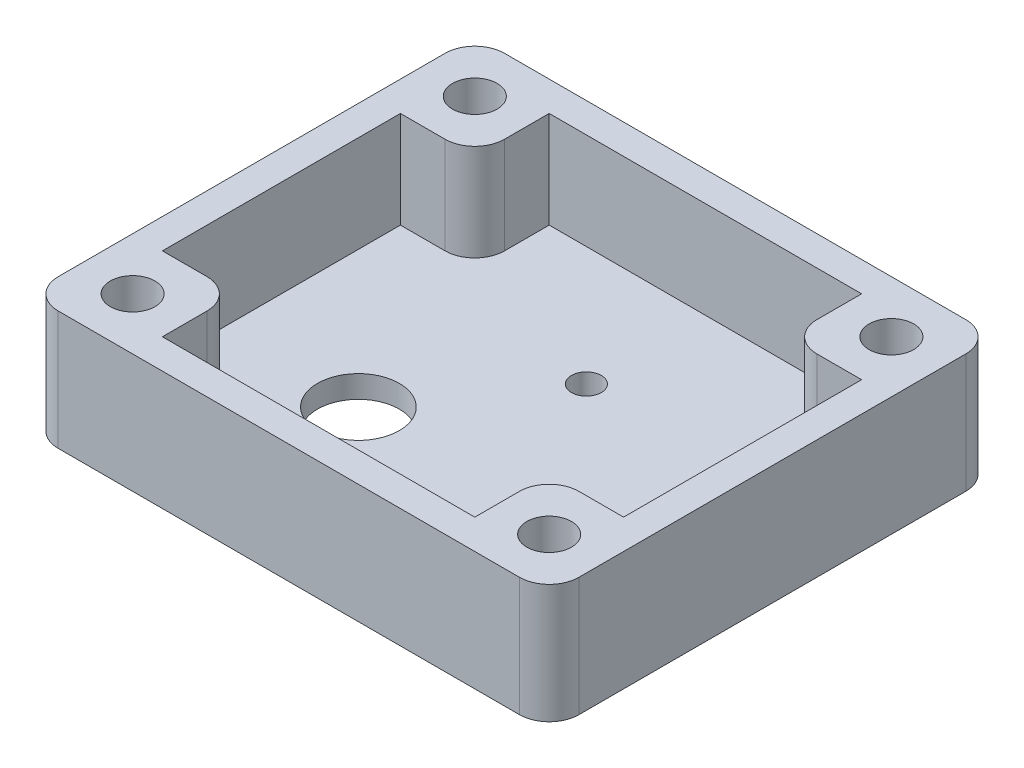
ISO-10303-21;
HEADER;
FILE_DESCRIPTION(('STEP AP214'),'2;1');
FILE_NAME('part.step','',(''),(''),'','','');
FILE_SCHEMA(('AUTOMOTIVE_DESIGN { 1 0 10303 214 1 1 1 1 }'));
ENDSEC;
DATA;
#1=APPLICATION_CONTEXT('core data for automotive mechanical design processes');
#2=APPLICATION_PROTOCOL_DEFINITION('international standard','automotive_design',2000,#1);
#3=PRODUCT_CONTEXT('',#1,'mechanical');
#4=PRODUCT('Part','Part','',(#3));
#5=PRODUCT_RELATED_PRODUCT_CATEGORY('part','',(#4));
#6=PRODUCT_DEFINITION_FORMATION('','',#4);
#7=PRODUCT_DEFINITION_CONTEXT('part definition',#1,'design');
#8=PRODUCT_DEFINITION('design','',#6,#7);
#9=PRODUCT_DEFINITION_SHAPE('','',#8);
#10=(LENGTH_UNIT() NAMED_UNIT(*) SI_UNIT(.MILLI.,.METRE.));
#11=(NAMED_UNIT(*) PLANE_ANGLE_UNIT() SI_UNIT($,.RADIAN.));
#12=(NAMED_UNIT(*) SI_UNIT($,.STERADIAN.) SOLID_ANGLE_UNIT());
#13=UNCERTAINTY_MEASURE_WITH_UNIT(LENGTH_MEASURE(1.E-05),#10,'distance_accuracy_value','');
#14=(GEOMETRIC_REPRESENTATION_CONTEXT(3) GLOBAL_UNCERTAINTY_ASSIGNED_CONTEXT((#13)) GLOBAL_UNIT_ASSIGNED_CONTEXT((#10,
#11,#12)) REPRESENTATION_CONTEXT('',''));
#15=CARTESIAN_POINT('',(0.,0.,0.));
#16=DIRECTION('',(0.,0.,1.));
#17=DIRECTION('',(1.,0.,0.));
#18=AXIS2_PLACEMENT_3D('',#15,#16,#17);
#19=CARTESIAN_POINT('',(0.,1.5,0.));
#20=DIRECTION('',(0.,1.,0.));
#21=DIRECTION('',(0.,0.,1.));
#22=AXIS2_PLACEMENT_3D('',#19,#20,#21);
#23=PLANE('',#22);
#24=DIRECTION('',(0.,0.,1.));
#25=VECTOR('',#24,1.);
#26=CARTESIAN_POINT('',(-10.5,1.5,-8.));
#27=LINE('',#26,#25);
#28=CARTESIAN_POINT('',(-10.5,1.5,-13.));
#29=VERTEX_POINT('',#28);
#30=CARTESIAN_POINT('',(-10.5,1.5,-10.));
#31=VERTEX_POINT('',#30);
#32=EDGE_CURVE('E259',#29,#31,#27,.T.);
#33=ORIENTED_EDGE('',*,*,#32,.T.);
#34=CARTESIAN_POINT('',(-12.5,1.5,-10.));
#35=DIRECTION('',(0.,1.,0.));
#36=DIRECTION('',(0.,0.,1.));
#37=AXIS2_PLACEMENT_3D('',#34,#35,#36);
#38=CIRCLE('',#37,2.);
#39=CARTESIAN_POINT('',(-12.5,1.5,-8.));
#40=VERTEX_POINT('',#39);
#41=EDGE_CURVE('E11',#31,#40,#38,.F.);
#42=ORIENTED_EDGE('',*,*,#41,.T.);
#43=DIRECTION('',(-1.,0.,0.));
#44=VECTOR('',#43,1.);
#45=CARTESIAN_POINT('',(-15.5,1.5,-8.));
#46=LINE('',#45,#44);
#47=CARTESIAN_POINT('',(-15.5,1.5,-8.));
#48=VERTEX_POINT('',#47);
#49=EDGE_CURVE('E262',#40,#48,#46,.T.);
#50=ORIENTED_EDGE('',*,*,#49,.T.);
#51=DIRECTION('',(0.,0.,1.));
#52=VECTOR('',#51,1.);
#53=CARTESIAN_POINT('',(-15.5,1.5,8.));
#54=LINE('',#53,#52);
#55=CARTESIAN_POINT('',(-15.5,1.5,8.));
#56=VERTEX_POINT('',#55);
#57=EDGE_CURVE('E216',#48,#56,#54,.T.);
#58=ORIENTED_EDGE('',*,*,#57,.T.);
#59=DIRECTION('',(1.,0.,0.));
#60=VECTOR('',#59,1.);
#61=CARTESIAN_POINT('',(-10.5,1.5,8.));
#62=LINE('',#61,#60);
#63=CARTESIAN_POINT('',(-12.5,1.5,8.));
#64=VERTEX_POINT('',#63);
#65=EDGE_CURVE('E268',#56,#64,#62,.T.);
#66=ORIENTED_EDGE('',*,*,#65,.T.);
#67=CARTESIAN_POINT('',(-12.5,1.5,10.));
#68=DIRECTION('',(0.,1.,0.));
#69=DIRECTION('',(0.,0.,1.));
#70=AXIS2_PLACEMENT_3D('',#67,#68,#69);
#71=CIRCLE('',#70,2.);
#72=CARTESIAN_POINT('',(-10.5,1.5,10.));
#73=VERTEX_POINT('',#72);
#74=EDGE_CURVE('E463',#64,#73,#71,.F.);
#75=ORIENTED_EDGE('',*,*,#74,.T.);
#76=DIRECTION('',(0.,0.,1.));
#77=VECTOR('',#76,1.);
#78=CARTESIAN_POINT('',(-10.5,1.5,13.));
#79=LINE('',#78,#77);
#80=CARTESIAN_POINT('',(-10.5,1.5,13.));
#81=VERTEX_POINT('',#80);
#82=EDGE_CURVE('E272',#73,#81,#79,.T.);
#83=ORIENTED_EDGE('',*,*,#82,.T.);
#84=DIRECTION('',(1.,0.,0.));
#85=VECTOR('',#84,1.);
#86=CARTESIAN_POINT('',(10.5,1.5,13.));
#87=LINE('',#86,#85);
#88=CARTESIAN_POINT('',(10.5,1.5,13.));
#89=VERTEX_POINT('',#88);
#90=EDGE_CURVE('E275',#81,#89,#87,.T.);
#91=ORIENTED_EDGE('',*,*,#90,.T.);
#92=DIRECTION('',(0.,0.,-1.));
#93=VECTOR('',#92,1.);
#94=CARTESIAN_POINT('',(10.5,1.5,8.));
#95=LINE('',#94,#93);
#96=CARTESIAN_POINT('',(10.5,1.5,10.));
#97=VERTEX_POINT('',#96);
#98=EDGE_CURVE('E278',#89,#97,#95,.T.);
#99=ORIENTED_EDGE('',*,*,#98,.T.);
#100=CARTESIAN_POINT('',(12.5,1.5,10.));
#101=DIRECTION('',(0.,1.,0.));
#102=DIRECTION('',(0.,0.,1.));
#103=AXIS2_PLACEMENT_3D('',#100,#101,#102);
#104=CIRCLE('',#103,2.);
#105=CARTESIAN_POINT('',(12.5,1.5,8.));
#106=VERTEX_POINT('',#105);
#107=EDGE_CURVE('E460',#97,#106,#104,.F.);
#108=ORIENTED_EDGE('',*,*,#107,.T.);
#109=DIRECTION('',(1.,0.,0.));
#110=VECTOR('',#109,1.);
#111=CARTESIAN_POINT('',(15.5,1.5,8.));
#112=LINE('',#111,#110);
#113=CARTESIAN_POINT('',(15.5,1.5,8.));
#114=VERTEX_POINT('',#113);
#115=EDGE_CURVE('E282',#106,#114,#112,.T.);
#116=ORIENTED_EDGE('',*,*,#115,.T.);
#117=DIRECTION('',(0.,0.,-1.));
#118=VECTOR('',#117,1.);
#119=CARTESIAN_POINT('',(15.5,1.5,-8.));
#120=LINE('',#119,#118);
#121=CARTESIAN_POINT('',(15.5,1.5,-8.));
#122=VERTEX_POINT('',#121);
#123=EDGE_CURVE('E285',#114,#122,#120,.T.);
#124=ORIENTED_EDGE('',*,*,#123,.T.);
#125=DIRECTION('',(-1.,0.,0.));
#126=VECTOR('',#125,1.);
#127=CARTESIAN_POINT('',(10.5,1.5,-8.));
#128=LINE('',#127,#126);
#129=CARTESIAN_POINT('',(12.5,1.5,-8.));
#130=VERTEX_POINT('',#129);
#131=EDGE_CURVE('E288',#122,#130,#128,.T.);
#132=ORIENTED_EDGE('',*,*,#131,.T.);
#133=CARTESIAN_POINT('',(12.5,1.5,-10.));
#134=DIRECTION('',(0.,1.,0.));
#135=DIRECTION('',(0.,0.,1.));
#136=AXIS2_PLACEMENT_3D('',#133,#134,#135);
#137=CIRCLE('',#136,2.);
#138=CARTESIAN_POINT('',(10.5,1.5,-10.));
#139=VERTEX_POINT('',#138);
#140=EDGE_CURVE('E48',#130,#139,#137,.F.);
#141=ORIENTED_EDGE('',*,*,#140,.T.);
#142=DIRECTION('',(0.,0.,-1.));
#143=VECTOR('',#142,1.);
#144=CARTESIAN_POINT('',(10.5,1.5,-13.));
#145=LINE('',#144,#143);
#146=CARTESIAN_POINT('',(10.5,1.5,-13.));
#147=VERTEX_POINT('',#146);
#148=EDGE_CURVE('E292',#139,#147,#145,.T.);
#149=ORIENTED_EDGE('',*,*,#148,.T.);
#150=DIRECTION('',(-1.,0.,0.));
#151=VECTOR('',#150,1.);
#152=CARTESIAN_POINT('',(-10.5,1.5,-13.));
#153=LINE('',#152,#151);
#154=EDGE_CURVE('E295',#147,#29,#153,.T.);
#155=ORIENTED_EDGE('',*,*,#154,.T.);
#156=EDGE_LOOP('',(#33,#42,#50,#58,#66,#75,#83,#91,#99,#108,#116,#124,#132,#141,#149,#155));
#157=FACE_BOUND('',#156,.T.);
#158=CARTESIAN_POINT('',(-6.32455,1.5,4.));
#159=DIRECTION('',(0.,1.,0.));
#160=DIRECTION('',(0.,0.,1.));
#161=AXIS2_PLACEMENT_3D('',#158,#159,#160);
#162=CIRCLE('',#161,2.75);
#163=CARTESIAN_POINT('',(-6.32455,1.5,6.75));
#164=VERTEX_POINT('',#163);
#165=EDGE_CURVE('E347',#164,#164,#162,.T.);
#166=ORIENTED_EDGE('',*,*,#165,.F.);
#167=EDGE_LOOP('',(#166));
#168=FACE_BOUND('',#167,.T.);
#169=CARTESIAN_POINT('',(0.,1.5,-5.));
#170=DIRECTION('',(0.,1.,0.));
#171=DIRECTION('',(0.,0.,1.));
#172=AXIS2_PLACEMENT_3D('',#169,#170,#171);
#173=CIRCLE('',#172,1.);
#174=CARTESIAN_POINT('',(0.,1.5,-4.));
#175=VERTEX_POINT('',#174);
#176=EDGE_CURVE('E339',#175,#175,#173,.T.);
#177=ORIENTED_EDGE('',*,*,#176,.F.);
#178=EDGE_LOOP('',(#177));
#179=FACE_BOUND('',#178,.T.);
#180=ADVANCED_FACE('F39',(#157,#168,#179),#23,.T.);
#181=CARTESIAN_POINT('',(0.,0.,0.));
#182=DIRECTION('',(0.,1.,0.));
#183=DIRECTION('',(0.,0.,1.));
#184=AXIS2_PLACEMENT_3D('',#181,#182,#183);
#185=PLANE('',#184);
#186=CARTESIAN_POINT('',(14.,0.,-11.5));
#187=DIRECTION('',(0.,1.,0.));
#188=DIRECTION('',(0.,0.,-1.));
#189=AXIS2_PLACEMENT_3D('',#186,#187,#188);
#190=CIRCLE('',#189,1.5);
#191=CARTESIAN_POINT('',(14.,0.,-13.));
#192=VERTEX_POINT('',#191);
#193=EDGE_CURVE('E537',#192,#192,#190,.T.);
#194=ORIENTED_EDGE('',*,*,#193,.T.);
#195=EDGE_LOOP('',(#194));
#196=FACE_BOUND('',#195,.T.);
#197=CARTESIAN_POINT('',(14.,0.,11.5));
#198=DIRECTION('',(0.,1.,0.));
#199=DIRECTION('',(0.,0.,1.));
#200=AXIS2_PLACEMENT_3D('',#197,#198,#199);
#201=CIRCLE('',#200,1.5);
#202=CARTESIAN_POINT('',(14.,0.,13.));
#203=VERTEX_POINT('',#202);
#204=EDGE_CURVE('E545',#203,#203,#201,.T.);
#205=ORIENTED_EDGE('',*,*,#204,.T.);
#206=EDGE_LOOP('',(#205));
#207=FACE_BOUND('',#206,.T.);
#208=CARTESIAN_POINT('',(-14.,0.,11.5));
#209=DIRECTION('',(0.,1.,0.));
#210=DIRECTION('',(0.,0.,-1.));
#211=AXIS2_PLACEMENT_3D('',#208,#209,#210);
#212=CIRCLE('',#211,1.5);
#213=CARTESIAN_POINT('',(-14.,0.,10.));
#214=VERTEX_POINT('',#213);
#215=EDGE_CURVE('E529',#214,#214,#212,.T.);
#216=ORIENTED_EDGE('',*,*,#215,.T.);
#217=EDGE_LOOP('',(#216));
#218=FACE_BOUND('',#217,.T.);
#219=CARTESIAN_POINT('',(-14.,0.,-11.5));
#220=DIRECTION('',(0.,1.,0.));
#221=DIRECTION('',(0.,0.,1.));
#222=AXIS2_PLACEMENT_3D('',#219,#220,#221);
#223=CIRCLE('',#222,1.5);
#224=CARTESIAN_POINT('',(-14.,0.,-10.));
#225=VERTEX_POINT('',#224);
#226=EDGE_CURVE('E263',#225,#225,#223,.T.);
#227=ORIENTED_EDGE('',*,*,#226,.T.);
#228=EDGE_LOOP('',(#227));
#229=FACE_BOUND('',#228,.T.);
#230=DIRECTION('',(0.,0.,1.));
#231=VECTOR('',#230,1.);
#232=CARTESIAN_POINT('',(-17.5,0.,-15.));
#233=LINE('',#232,#231);
#234=CARTESIAN_POINT('',(-17.5,0.,-13.));
#235=VERTEX_POINT('',#234);
#236=CARTESIAN_POINT('',(-17.5,0.,13.));
#237=VERTEX_POINT('',#236);
#238=EDGE_CURVE('E362',#235,#237,#233,.T.);
#239=ORIENTED_EDGE('',*,*,#238,.F.);
#240=CARTESIAN_POINT('',(-15.5,0.,-13.));
#241=DIRECTION('',(0.,1.,0.));
#242=DIRECTION('',(0.,0.,1.));
#243=AXIS2_PLACEMENT_3D('',#240,#241,#242);
#244=CIRCLE('',#243,2.);
#245=CARTESIAN_POINT('',(-15.5,0.,-15.));
#246=VERTEX_POINT('',#245);
#247=EDGE_CURVE('E386',#235,#246,#244,.F.);
#248=ORIENTED_EDGE('',*,*,#247,.T.);
#249=DIRECTION('',(-1.,0.,0.));
#250=VECTOR('',#249,1.);
#251=CARTESIAN_POINT('',(-17.5,0.,-15.));
#252=LINE('',#251,#250);
#253=CARTESIAN_POINT('',(15.5,0.,-15.));
#254=VERTEX_POINT('',#253);
#255=EDGE_CURVE('E358',#254,#246,#252,.T.);
#256=ORIENTED_EDGE('',*,*,#255,.F.);
#257=CARTESIAN_POINT('',(15.5,0.,-13.));
#258=DIRECTION('',(0.,1.,0.));
#259=DIRECTION('',(0.,0.,1.));
#260=AXIS2_PLACEMENT_3D('',#257,#258,#259);
#261=CIRCLE('',#260,2.);
#262=CARTESIAN_POINT('',(17.5,0.,-13.));
#263=VERTEX_POINT('',#262);
#264=EDGE_CURVE('E377',#254,#263,#261,.F.);
#265=ORIENTED_EDGE('',*,*,#264,.T.);
#266=DIRECTION('',(0.,0.,-1.));
#267=VECTOR('',#266,1.);
#268=CARTESIAN_POINT('',(17.5,0.,-15.));
#269=LINE('',#268,#267);
#270=CARTESIAN_POINT('',(17.5,0.,13.));
#271=VERTEX_POINT('',#270);
#272=EDGE_CURVE('E351',#271,#263,#269,.T.);
#273=ORIENTED_EDGE('',*,*,#272,.F.);
#274=CARTESIAN_POINT('',(15.5,0.,13.));
#275=DIRECTION('',(0.,1.,0.));
#276=DIRECTION('',(0.,0.,1.));
#277=AXIS2_PLACEMENT_3D('',#274,#275,#276);
#278=CIRCLE('',#277,2.);
#279=CARTESIAN_POINT('',(15.5,0.,15.));
#280=VERTEX_POINT('',#279);
#281=EDGE_CURVE('E380',#271,#280,#278,.F.);
#282=ORIENTED_EDGE('',*,*,#281,.T.);
#283=DIRECTION('',(1.,0.,0.));
#284=VECTOR('',#283,1.);
#285=CARTESIAN_POINT('',(-17.5,0.,15.));
#286=LINE('',#285,#284);
#287=CARTESIAN_POINT('',(-15.5,0.,15.));
#288=VERTEX_POINT('',#287);
#289=EDGE_CURVE('E366',#288,#280,#286,.T.);
#290=ORIENTED_EDGE('',*,*,#289,.F.);
#291=CARTESIAN_POINT('',(-15.5,0.,13.));
#292=DIRECTION('',(0.,1.,0.));
#293=DIRECTION('',(0.,0.,1.));
#294=AXIS2_PLACEMENT_3D('',#291,#292,#293);
#295=CIRCLE('',#294,2.);
#296=EDGE_CURVE('E383',#288,#237,#295,.F.);
#297=ORIENTED_EDGE('',*,*,#296,.T.);
#298=EDGE_LOOP('',(#239,#248,#256,#265,#273,#282,#290,#297));
#299=FACE_BOUND('',#298,.T.);
#300=CARTESIAN_POINT('',(-6.32455,0.,4.));
#301=DIRECTION('',(0.,1.,0.));
#302=DIRECTION('',(0.,0.,1.));
#303=AXIS2_PLACEMENT_3D('',#300,#301,#302);
#304=CIRCLE('',#303,2.75);
#305=CARTESIAN_POINT('',(-6.32455,0.,6.75));
#306=VERTEX_POINT('',#305);
#307=EDGE_CURVE('E343',#306,#306,#304,.T.);
#308=ORIENTED_EDGE('',*,*,#307,.T.);
#309=EDGE_LOOP('',(#308));
#310=FACE_BOUND('',#309,.T.);
#311=CARTESIAN_POINT('',(0.,0.,-5.));
#312=DIRECTION('',(0.,1.,0.));
#313=DIRECTION('',(0.,0.,1.));
#314=AXIS2_PLACEMENT_3D('',#311,#312,#313);
#315=CIRCLE('',#314,1.);
#316=CARTESIAN_POINT('',(0.,0.,-4.));
#317=VERTEX_POINT('',#316);
#318=EDGE_CURVE('E338',#317,#317,#315,.T.);
#319=ORIENTED_EDGE('',*,*,#318,.T.);
#320=EDGE_LOOP('',(#319));
#321=FACE_BOUND('',#320,.T.);
#322=ADVANCED_FACE('F557',(#196,#207,#218,#229,#299,#310,#321),#185,.F.);
#323=CARTESIAN_POINT('',(17.5,1.5,-15.));
#324=DIRECTION('',(-1.,0.,0.));
#325=DIRECTION('',(0.,0.,1.));
#326=AXIS2_PLACEMENT_3D('',#323,#324,#325);
#327=PLANE('',#326);
#328=DIRECTION('',(0.,0.,-1.));
#329=VECTOR('',#328,1.);
#330=CARTESIAN_POINT('',(17.5,8.,-15.));
#331=LINE('',#330,#329);
#332=CARTESIAN_POINT('',(17.5,8.,13.));
#333=VERTEX_POINT('',#332);
#334=CARTESIAN_POINT('',(17.5,8.,-13.));
#335=VERTEX_POINT('',#334);
#336=EDGE_CURVE('E218',#333,#335,#331,.T.);
#337=ORIENTED_EDGE('',*,*,#336,.F.);
#338=DIRECTION('',(0.,-1.,0.));
#339=VECTOR('',#338,1.);
#340=CARTESIAN_POINT('',(17.5,1.5,13.));
#341=LINE('',#340,#339);
#342=EDGE_CURVE('E444',#333,#271,#341,.T.);
#343=ORIENTED_EDGE('',*,*,#342,.T.);
#344=ORIENTED_EDGE('',*,*,#272,.T.);
#345=DIRECTION('',(0.,-1.,0.));
#346=VECTOR('',#345,1.);
#347=CARTESIAN_POINT('',(17.5,1.5,-13.));
#348=LINE('',#347,#346);
#349=EDGE_CURVE('E441',#263,#335,#348,.F.);
#350=ORIENTED_EDGE('',*,*,#349,.T.);
#351=EDGE_LOOP('',(#337,#343,#344,#350));
#352=FACE_BOUND('',#351,.T.);
#353=ADVANCED_FACE('F608',(#352),#327,.F.);
#354=CARTESIAN_POINT('',(-17.5,1.5,-15.));
#355=DIRECTION('',(0.,0.,1.));
#356=DIRECTION('',(1.,0.,0.));
#357=AXIS2_PLACEMENT_3D('',#354,#355,#356);
#358=PLANE('',#357);
#359=ORIENTED_EDGE('',*,*,#255,.T.);
#360=DIRECTION('',(0.,-1.,0.));
#361=VECTOR('',#360,1.);
#362=CARTESIAN_POINT('',(-15.5,1.5,-15.));
#363=LINE('',#362,#361);
#364=CARTESIAN_POINT('',(-15.5,8.,-15.));
#365=VERTEX_POINT('',#364);
#366=EDGE_CURVE('E393',#246,#365,#363,.F.);
#367=ORIENTED_EDGE('',*,*,#366,.T.);
#368=DIRECTION('',(-1.,0.,0.));
#369=VECTOR('',#368,1.);
#370=CARTESIAN_POINT('',(-17.5,8.,-15.));
#371=LINE('',#370,#369);
#372=CARTESIAN_POINT('',(15.5,8.,-15.));
#373=VERTEX_POINT('',#372);
#374=EDGE_CURVE('E326',#373,#365,#371,.T.);
#375=ORIENTED_EDGE('',*,*,#374,.F.);
#376=DIRECTION('',(0.,-1.,0.));
#377=VECTOR('',#376,1.);
#378=CARTESIAN_POINT('',(15.5,1.5,-15.));
#379=LINE('',#378,#377);
#380=EDGE_CURVE('E389',#373,#254,#379,.T.);
#381=ORIENTED_EDGE('',*,*,#380,.T.);
#382=EDGE_LOOP('',(#359,#367,#375,#381));
#383=FACE_BOUND('',#382,.T.);
#384=ADVANCED_FACE('F612',(#383),#358,.F.);
#385=CARTESIAN_POINT('',(-17.5,1.5,-15.));
#386=DIRECTION('',(1.,0.,0.));
#387=DIRECTION('',(0.,0.,-1.));
#388=AXIS2_PLACEMENT_3D('',#385,#386,#387);
#389=PLANE('',#388);
#390=DIRECTION('',(0.,0.,1.));
#391=VECTOR('',#390,1.);
#392=CARTESIAN_POINT('',(-17.5,8.,-15.));
#393=LINE('',#392,#391);
#394=CARTESIAN_POINT('',(-17.5,8.,-13.));
#395=VERTEX_POINT('',#394);
#396=CARTESIAN_POINT('',(-17.5,8.,13.));
#397=VERTEX_POINT('',#396);
#398=EDGE_CURVE('E330',#395,#397,#393,.T.);
#399=ORIENTED_EDGE('',*,*,#398,.F.);
#400=DIRECTION('',(0.,-1.,0.));
#401=VECTOR('',#400,1.);
#402=CARTESIAN_POINT('',(-17.5,1.5,-13.));
#403=LINE('',#402,#401);
#404=EDGE_CURVE('E373',#395,#235,#403,.T.);
#405=ORIENTED_EDGE('',*,*,#404,.T.);
#406=ORIENTED_EDGE('',*,*,#238,.T.);
#407=DIRECTION('',(0.,-1.,0.));
#408=VECTOR('',#407,1.);
#409=CARTESIAN_POINT('',(-17.5,1.5,13.));
#410=LINE('',#409,#408);
#411=EDGE_CURVE('E370',#237,#397,#410,.F.);
#412=ORIENTED_EDGE('',*,*,#411,.T.);
#413=EDGE_LOOP('',(#399,#405,#406,#412));
#414=FACE_BOUND('',#413,.T.);
#415=ADVANCED_FACE('F587',(#414),#389,.F.);
#416=CARTESIAN_POINT('',(-17.5,1.5,15.));
#417=DIRECTION('',(0.,0.,-1.));
#418=DIRECTION('',(-1.,0.,0.));
#419=AXIS2_PLACEMENT_3D('',#416,#417,#418);
#420=PLANE('',#419);
#421=DIRECTION('',(1.,0.,0.));
#422=VECTOR('',#421,1.);
#423=CARTESIAN_POINT('',(-17.5,8.,15.));
#424=LINE('',#423,#422);
#425=CARTESIAN_POINT('',(-15.5,8.,15.));
#426=VERTEX_POINT('',#425);
#427=CARTESIAN_POINT('',(15.5,8.,15.));
#428=VERTEX_POINT('',#427);
#429=EDGE_CURVE('E334',#426,#428,#424,.T.);
#430=ORIENTED_EDGE('',*,*,#429,.F.);
#431=DIRECTION('',(0.,-1.,0.));
#432=VECTOR('',#431,1.);
#433=CARTESIAN_POINT('',(-15.5,1.5,15.));
#434=LINE('',#433,#432);
#435=EDGE_CURVE('E430',#426,#288,#434,.T.);
#436=ORIENTED_EDGE('',*,*,#435,.T.);
#437=ORIENTED_EDGE('',*,*,#289,.T.);
#438=DIRECTION('',(0.,-1.,0.));
#439=VECTOR('',#438,1.);
#440=CARTESIAN_POINT('',(15.5,1.5,15.));
#441=LINE('',#440,#439);
#442=EDGE_CURVE('E427',#280,#428,#441,.F.);
#443=ORIENTED_EDGE('',*,*,#442,.T.);
#444=EDGE_LOOP('',(#430,#436,#437,#443));
#445=FACE_BOUND('',#444,.T.);
#446=ADVANCED_FACE('F599',(#445),#420,.F.);
#447=CARTESIAN_POINT('',(-6.32455,1.5,4.));
#448=DIRECTION('',(0.,-1.,0.));
#449=DIRECTION('',(0.,0.,-1.));
#450=AXIS2_PLACEMENT_3D('',#447,#448,#449);
#451=CYLINDRICAL_SURFACE('',#450,2.75);
#452=ORIENTED_EDGE('',*,*,#165,.T.);
#453=EDGE_LOOP('',(#452));
#454=FACE_BOUND('',#453,.T.);
#455=ORIENTED_EDGE('',*,*,#307,.F.);
#456=EDGE_LOOP('',(#455));
#457=FACE_BOUND('',#456,.T.);
#458=ADVANCED_FACE('F629',(#454,#457),#451,.F.);
#459=CARTESIAN_POINT('',(0.,1.5,-5.));
#460=DIRECTION('',(0.,-1.,0.));
#461=DIRECTION('',(0.,0.,-1.));
#462=AXIS2_PLACEMENT_3D('',#459,#460,#461);
#463=CYLINDRICAL_SURFACE('',#462,1.);
#464=ORIENTED_EDGE('',*,*,#176,.T.);
#465=EDGE_LOOP('',(#464));
#466=FACE_BOUND('',#465,.T.);
#467=ORIENTED_EDGE('',*,*,#318,.F.);
#468=EDGE_LOOP('',(#467));
#469=FACE_BOUND('',#468,.T.);
#470=ADVANCED_FACE('F570',(#466,#469),#463,.F.);
#471=CARTESIAN_POINT('',(0.,8.,0.));
#472=DIRECTION('',(0.,1.,0.));
#473=DIRECTION('',(0.,0.,1.));
#474=AXIS2_PLACEMENT_3D('',#471,#472,#473);
#475=PLANE('',#474);
#476=CARTESIAN_POINT('',(14.,8.,-11.5));
#477=DIRECTION('',(0.,1.,0.));
#478=DIRECTION('',(0.,0.,-1.));
#479=AXIS2_PLACEMENT_3D('',#476,#477,#478);
#480=CIRCLE('',#479,1.5);
#481=CARTESIAN_POINT('',(14.,8.,-13.));
#482=VERTEX_POINT('',#481);
#483=EDGE_CURVE('E533',#482,#482,#480,.T.);
#484=ORIENTED_EDGE('',*,*,#483,.F.);
#485=EDGE_LOOP('',(#484));
#486=FACE_BOUND('',#485,.T.);
#487=CARTESIAN_POINT('',(14.,8.,11.5));
#488=DIRECTION('',(0.,1.,0.));
#489=DIRECTION('',(0.,0.,1.));
#490=AXIS2_PLACEMENT_3D('',#487,#488,#489);
#491=CIRCLE('',#490,1.5);
#492=CARTESIAN_POINT('',(14.,8.,13.));
#493=VERTEX_POINT('',#492);
#494=EDGE_CURVE('E541',#493,#493,#491,.T.);
#495=ORIENTED_EDGE('',*,*,#494,.F.);
#496=EDGE_LOOP('',(#495));
#497=FACE_BOUND('',#496,.T.);
#498=CARTESIAN_POINT('',(-14.,8.,11.5));
#499=DIRECTION('',(0.,1.,0.));
#500=DIRECTION('',(0.,0.,-1.));
#501=AXIS2_PLACEMENT_3D('',#498,#499,#500);
#502=CIRCLE('',#501,1.5);
#503=CARTESIAN_POINT('',(-14.,8.,10.));
#504=VERTEX_POINT('',#503);
#505=EDGE_CURVE('E549',#504,#504,#502,.T.);
#506=ORIENTED_EDGE('',*,*,#505,.F.);
#507=EDGE_LOOP('',(#506));
#508=FACE_BOUND('',#507,.T.);
#509=CARTESIAN_POINT('',(-14.,8.,-11.5));
#510=DIRECTION('',(0.,1.,0.));
#511=DIRECTION('',(0.,0.,1.));
#512=AXIS2_PLACEMENT_3D('',#509,#510,#511);
#513=CIRCLE('',#512,1.5);
#514=CARTESIAN_POINT('',(-14.,8.,-10.));
#515=VERTEX_POINT('',#514);
#516=EDGE_CURVE('E525',#515,#515,#513,.T.);
#517=ORIENTED_EDGE('',*,*,#516,.F.);
#518=EDGE_LOOP('',(#517));
#519=FACE_BOUND('',#518,.T.);
#520=ORIENTED_EDGE('',*,*,#374,.T.);
#521=CARTESIAN_POINT('',(-15.5,8.,-13.));
#522=DIRECTION('',(0.,1.,0.));
#523=DIRECTION('',(0.,0.,1.));
#524=AXIS2_PLACEMENT_3D('',#521,#522,#523);
#525=CIRCLE('',#524,2.);
#526=EDGE_CURVE('E417',#365,#395,#525,.T.);
#527=ORIENTED_EDGE('',*,*,#526,.T.);
#528=ORIENTED_EDGE('',*,*,#398,.T.);
#529=CARTESIAN_POINT('',(-15.5,8.,13.));
#530=DIRECTION('',(0.,1.,0.));
#531=DIRECTION('',(0.,0.,1.));
#532=AXIS2_PLACEMENT_3D('',#529,#530,#531);
#533=CIRCLE('',#532,2.);
#534=EDGE_CURVE('E411',#397,#426,#533,.T.);
#535=ORIENTED_EDGE('',*,*,#534,.T.);
#536=ORIENTED_EDGE('',*,*,#429,.T.);
#537=CARTESIAN_POINT('',(15.5,8.,13.));
#538=DIRECTION('',(0.,1.,0.));
#539=DIRECTION('',(0.,0.,1.));
#540=AXIS2_PLACEMENT_3D('',#537,#538,#539);
#541=CIRCLE('',#540,2.);
#542=EDGE_CURVE('E405',#428,#333,#541,.T.);
#543=ORIENTED_EDGE('',*,*,#542,.T.);
#544=ORIENTED_EDGE('',*,*,#336,.T.);
#545=CARTESIAN_POINT('',(15.5,8.,-13.));
#546=DIRECTION('',(0.,1.,0.));
#547=DIRECTION('',(0.,0.,1.));
#548=AXIS2_PLACEMENT_3D('',#545,#546,#547);
#549=CIRCLE('',#548,2.);
#550=EDGE_CURVE('E402',#335,#373,#549,.T.);
#551=ORIENTED_EDGE('',*,*,#550,.T.);
#552=EDGE_LOOP('',(#520,#527,#528,#535,#536,#543,#544,#551));
#553=FACE_BOUND('',#552,.T.);
#554=DIRECTION('',(1.,0.,0.));
#555=VECTOR('',#554,1.);
#556=CARTESIAN_POINT('',(15.5,8.,8.));
#557=LINE('',#556,#555);
#558=CARTESIAN_POINT('',(12.5,8.,8.));
#559=VERTEX_POINT('',#558);
#560=CARTESIAN_POINT('',(15.5,8.,8.));
#561=VERTEX_POINT('',#560);
#562=EDGE_CURVE('E242',#559,#561,#557,.T.);
#563=ORIENTED_EDGE('',*,*,#562,.F.);
#564=CARTESIAN_POINT('',(12.5,8.,10.));
#565=DIRECTION('',(0.,1.,0.));
#566=DIRECTION('',(0.,0.,1.));
#567=AXIS2_PLACEMENT_3D('',#564,#565,#566);
#568=CIRCLE('',#567,2.);
#569=CARTESIAN_POINT('',(10.5,8.,10.));
#570=VERTEX_POINT('',#569);
#571=EDGE_CURVE('E414',#559,#570,#568,.T.);
#572=ORIENTED_EDGE('',*,*,#571,.T.);
#573=DIRECTION('',(0.,0.,-1.));
#574=VECTOR('',#573,1.);
#575=CARTESIAN_POINT('',(10.5,8.,8.));
#576=LINE('',#575,#574);
#577=CARTESIAN_POINT('',(10.5,8.,13.));
#578=VERTEX_POINT('',#577);
#579=EDGE_CURVE('E238',#578,#570,#576,.T.);
#580=ORIENTED_EDGE('',*,*,#579,.F.);
#581=DIRECTION('',(1.,0.,0.));
#582=VECTOR('',#581,1.);
#583=CARTESIAN_POINT('',(10.5,8.,13.));
#584=LINE('',#583,#582);
#585=CARTESIAN_POINT('',(-10.5,8.,13.));
#586=VERTEX_POINT('',#585);
#587=EDGE_CURVE('E235',#586,#578,#584,.T.);
#588=ORIENTED_EDGE('',*,*,#587,.F.);
#589=DIRECTION('',(0.,0.,1.));
#590=VECTOR('',#589,1.);
#591=CARTESIAN_POINT('',(-10.5,8.,13.));
#592=LINE('',#591,#590);
#593=CARTESIAN_POINT('',(-10.5,8.,10.));
#594=VERTEX_POINT('',#593);
#595=EDGE_CURVE('E229',#594,#586,#592,.T.);
#596=ORIENTED_EDGE('',*,*,#595,.F.);
#597=CARTESIAN_POINT('',(-12.5,8.,10.));
#598=DIRECTION('',(0.,1.,0.));
#599=DIRECTION('',(0.,0.,1.));
#600=AXIS2_PLACEMENT_3D('',#597,#598,#599);
#601=CIRCLE('',#600,2.);
#602=CARTESIAN_POINT('',(-12.5,8.,8.));
#603=VERTEX_POINT('',#602);
#604=EDGE_CURVE('E408',#594,#603,#601,.T.);
#605=ORIENTED_EDGE('',*,*,#604,.T.);
#606=DIRECTION('',(1.,0.,0.));
#607=VECTOR('',#606,1.);
#608=CARTESIAN_POINT('',(-10.5,8.,8.));
#609=LINE('',#608,#607);
#610=CARTESIAN_POINT('',(-15.5,8.,8.));
#611=VERTEX_POINT('',#610);
#612=EDGE_CURVE('E225',#611,#603,#609,.T.);
#613=ORIENTED_EDGE('',*,*,#612,.F.);
#614=DIRECTION('',(0.,0.,1.));
#615=VECTOR('',#614,1.);
#616=CARTESIAN_POINT('',(-15.5,8.,8.));
#617=LINE('',#616,#615);
#618=CARTESIAN_POINT('',(-15.5,8.,-8.));
#619=VERTEX_POINT('',#618);
#620=EDGE_CURVE('E209',#619,#611,#617,.T.);
#621=ORIENTED_EDGE('',*,*,#620,.F.);
#622=DIRECTION('',(-1.,0.,0.));
#623=VECTOR('',#622,1.);
#624=CARTESIAN_POINT('',(-15.5,8.,-8.));
#625=LINE('',#624,#623);
#626=CARTESIAN_POINT('',(-12.5,8.,-8.));
#627=VERTEX_POINT('',#626);
#628=EDGE_CURVE('E199',#627,#619,#625,.T.);
#629=ORIENTED_EDGE('',*,*,#628,.F.);
#630=CARTESIAN_POINT('',(-12.5,8.,-10.));
#631=DIRECTION('',(0.,1.,0.));
#632=DIRECTION('',(0.,0.,1.));
#633=AXIS2_PLACEMENT_3D('',#630,#631,#632);
#634=CIRCLE('',#633,2.);
#635=CARTESIAN_POINT('',(-10.5,8.,-10.));
#636=VERTEX_POINT('',#635);
#637=EDGE_CURVE('E396',#627,#636,#634,.T.);
#638=ORIENTED_EDGE('',*,*,#637,.T.);
#639=DIRECTION('',(0.,0.,1.));
#640=VECTOR('',#639,1.);
#641=CARTESIAN_POINT('',(-10.5,8.,-8.));
#642=LINE('',#641,#640);
#643=CARTESIAN_POINT('',(-10.5,8.,-13.));
#644=VERTEX_POINT('',#643);
#645=EDGE_CURVE('E210',#644,#636,#642,.T.);
#646=ORIENTED_EDGE('',*,*,#645,.F.);
#647=DIRECTION('',(-1.,0.,0.));
#648=VECTOR('',#647,1.);
#649=CARTESIAN_POINT('',(-10.5,8.,-13.));
#650=LINE('',#649,#648);
#651=CARTESIAN_POINT('',(10.5,8.,-13.));
#652=VERTEX_POINT('',#651);
#653=EDGE_CURVE('E255',#652,#644,#650,.T.);
#654=ORIENTED_EDGE('',*,*,#653,.F.);
#655=DIRECTION('',(0.,0.,-1.));
#656=VECTOR('',#655,1.);
#657=CARTESIAN_POINT('',(10.5,8.,-13.));
#658=LINE('',#657,#656);
#659=CARTESIAN_POINT('',(10.5,8.,-10.));
#660=VERTEX_POINT('',#659);
#661=EDGE_CURVE('E252',#660,#652,#658,.T.);
#662=ORIENTED_EDGE('',*,*,#661,.F.);
#663=CARTESIAN_POINT('',(12.5,8.,-10.));
#664=DIRECTION('',(0.,1.,0.));
#665=DIRECTION('',(0.,0.,1.));
#666=AXIS2_PLACEMENT_3D('',#663,#664,#665);
#667=CIRCLE('',#666,2.);
#668=CARTESIAN_POINT('',(12.5,8.,-8.));
#669=VERTEX_POINT('',#668);
#670=EDGE_CURVE('E399',#660,#669,#667,.T.);
#671=ORIENTED_EDGE('',*,*,#670,.T.);
#672=DIRECTION('',(-1.,0.,0.));
#673=VECTOR('',#672,1.);
#674=CARTESIAN_POINT('',(10.5,8.,-8.));
#675=LINE('',#674,#673);
#676=CARTESIAN_POINT('',(15.5,8.,-8.));
#677=VERTEX_POINT('',#676);
#678=EDGE_CURVE('E248',#677,#669,#675,.T.);
#679=ORIENTED_EDGE('',*,*,#678,.F.);
#680=DIRECTION('',(0.,0.,-1.));
#681=VECTOR('',#680,1.);
#682=CARTESIAN_POINT('',(15.5,8.,-8.));
#683=LINE('',#682,#681);
#684=EDGE_CURVE('E245',#561,#677,#683,.T.);
#685=ORIENTED_EDGE('',*,*,#684,.F.);
#686=EDGE_LOOP('',(#563,#572,#580,#588,#596,#605,#613,#621,#629,#638,#646,#654,#662,#671,#679,#685));
#687=FACE_BOUND('',#686,.T.);
#688=ADVANCED_FACE('F223',(#486,#497,#508,#519,#553,#687),#475,.T.);
#689=CARTESIAN_POINT('',(-10.5,8.,-8.));
#690=DIRECTION('',(1.,0.,0.));
#691=DIRECTION('',(0.,0.,-1.));
#692=AXIS2_PLACEMENT_3D('',#689,#690,#691);
#693=PLANE('',#692);
#694=ORIENTED_EDGE('',*,*,#645,.T.);
#695=DIRECTION('',(0.,-1.,0.));
#696=VECTOR('',#695,1.);
#697=CARTESIAN_POINT('',(-10.5,8.,-10.));
#698=LINE('',#697,#696);
#699=EDGE_CURVE('E455',#636,#31,#698,.T.);
#700=ORIENTED_EDGE('',*,*,#699,.T.);
#701=ORIENTED_EDGE('',*,*,#32,.F.);
#702=DIRECTION('',(0.,-1.,0.));
#703=VECTOR('',#702,1.);
#704=CARTESIAN_POINT('',(-10.5,8.,-13.));
#705=LINE('',#704,#703);
#706=EDGE_CURVE('E258',#644,#29,#705,.T.);
#707=ORIENTED_EDGE('',*,*,#706,.F.);
#708=EDGE_LOOP('',(#694,#700,#701,#707));
#709=FACE_BOUND('',#708,.T.);
#710=ADVANCED_FACE('F521',(#709),#693,.T.);
#711=CARTESIAN_POINT('',(-15.5,8.,-8.));
#712=DIRECTION('',(0.,0.,1.));
#713=DIRECTION('',(1.,0.,0.));
#714=AXIS2_PLACEMENT_3D('',#711,#712,#713);
#715=PLANE('',#714);
#716=ORIENTED_EDGE('',*,*,#49,.F.);
#717=DIRECTION('',(0.,-1.,0.));
#718=VECTOR('',#717,1.);
#719=CARTESIAN_POINT('',(-12.5,8.,-8.));
#720=LINE('',#719,#718);
#721=EDGE_CURVE('E204',#40,#627,#720,.F.);
#722=ORIENTED_EDGE('',*,*,#721,.T.);
#723=ORIENTED_EDGE('',*,*,#628,.T.);
#724=DIRECTION('',(0.,-1.,0.));
#725=VECTOR('',#724,1.);
#726=CARTESIAN_POINT('',(-15.5,8.,-8.));
#727=LINE('',#726,#725);
#728=EDGE_CURVE('E202',#619,#48,#727,.T.);
#729=ORIENTED_EDGE('',*,*,#728,.T.);
#730=EDGE_LOOP('',(#716,#722,#723,#729));
#731=FACE_BOUND('',#730,.T.);
#732=ADVANCED_FACE('F201',(#731),#715,.T.);
#733=CARTESIAN_POINT('',(-15.5,8.,8.));
#734=DIRECTION('',(1.,0.,0.));
#735=DIRECTION('',(0.,0.,-1.));
#736=AXIS2_PLACEMENT_3D('',#733,#734,#735);
#737=PLANE('',#736);
#738=ORIENTED_EDGE('',*,*,#57,.F.);
#739=ORIENTED_EDGE('',*,*,#728,.F.);
#740=ORIENTED_EDGE('',*,*,#620,.T.);
#741=DIRECTION('',(0.,-1.,0.));
#742=VECTOR('',#741,1.);
#743=CARTESIAN_POINT('',(-15.5,8.,8.));
#744=LINE('',#743,#742);
#745=EDGE_CURVE('E219',#611,#56,#744,.T.);
#746=ORIENTED_EDGE('',*,*,#745,.T.);
#747=EDGE_LOOP('',(#738,#739,#740,#746));
#748=FACE_BOUND('',#747,.T.);
#749=ADVANCED_FACE('F213',(#748),#737,.T.);
#750=CARTESIAN_POINT('',(-10.5,8.,8.));
#751=DIRECTION('',(0.,0.,-1.));
#752=DIRECTION('',(-1.,0.,0.));
#753=AXIS2_PLACEMENT_3D('',#750,#751,#752);
#754=PLANE('',#753);
#755=ORIENTED_EDGE('',*,*,#612,.T.);
#756=DIRECTION('',(0.,-1.,0.));
#757=VECTOR('',#756,1.);
#758=CARTESIAN_POINT('',(-12.5,8.,8.));
#759=LINE('',#758,#757);
#760=EDGE_CURVE('E434',#603,#64,#759,.T.);
#761=ORIENTED_EDGE('',*,*,#760,.T.);
#762=ORIENTED_EDGE('',*,*,#65,.F.);
#763=ORIENTED_EDGE('',*,*,#745,.F.);
#764=EDGE_LOOP('',(#755,#761,#762,#763));
#765=FACE_BOUND('',#764,.T.);
#766=ADVANCED_FACE('F516',(#765),#754,.T.);
#767=CARTESIAN_POINT('',(-10.5,8.,13.));
#768=DIRECTION('',(1.,0.,0.));
#769=DIRECTION('',(0.,0.,-1.));
#770=AXIS2_PLACEMENT_3D('',#767,#768,#769);
#771=PLANE('',#770);
#772=ORIENTED_EDGE('',*,*,#82,.F.);
#773=DIRECTION('',(0.,-1.,0.));
#774=VECTOR('',#773,1.);
#775=CARTESIAN_POINT('',(-10.5,8.,10.));
#776=LINE('',#775,#774);
#777=EDGE_CURVE('E438',#73,#594,#776,.F.);
#778=ORIENTED_EDGE('',*,*,#777,.T.);
#779=ORIENTED_EDGE('',*,*,#595,.T.);
#780=DIRECTION('',(0.,-1.,0.));
#781=VECTOR('',#780,1.);
#782=CARTESIAN_POINT('',(-10.5,8.,13.));
#783=LINE('',#782,#781);
#784=EDGE_CURVE('E317',#586,#81,#783,.T.);
#785=ORIENTED_EDGE('',*,*,#784,.T.);
#786=EDGE_LOOP('',(#772,#778,#779,#785));
#787=FACE_BOUND('',#786,.T.);
#788=ADVANCED_FACE('F660',(#787),#771,.T.);
#789=CARTESIAN_POINT('',(10.5,8.,13.));
#790=DIRECTION('',(0.,0.,-1.));
#791=DIRECTION('',(-1.,0.,0.));
#792=AXIS2_PLACEMENT_3D('',#789,#790,#791);
#793=PLANE('',#792);
#794=ORIENTED_EDGE('',*,*,#90,.F.);
#795=ORIENTED_EDGE('',*,*,#784,.F.);
#796=ORIENTED_EDGE('',*,*,#587,.T.);
#797=DIRECTION('',(0.,-1.,0.));
#798=VECTOR('',#797,1.);
#799=CARTESIAN_POINT('',(10.5,8.,13.));
#800=LINE('',#799,#798);
#801=EDGE_CURVE('E313',#578,#89,#800,.T.);
#802=ORIENTED_EDGE('',*,*,#801,.T.);
#803=EDGE_LOOP('',(#794,#795,#796,#802));
#804=FACE_BOUND('',#803,.T.);
#805=ADVANCED_FACE('F505',(#804),#793,.T.);
#806=CARTESIAN_POINT('',(10.5,8.,8.));
#807=DIRECTION('',(-1.,0.,0.));
#808=DIRECTION('',(0.,0.,1.));
#809=AXIS2_PLACEMENT_3D('',#806,#807,#808);
#810=PLANE('',#809);
#811=ORIENTED_EDGE('',*,*,#579,.T.);
#812=DIRECTION('',(0.,-1.,0.));
#813=VECTOR('',#812,1.);
#814=CARTESIAN_POINT('',(10.5,8.,10.));
#815=LINE('',#814,#813);
#816=EDGE_CURVE('E420',#570,#97,#815,.T.);
#817=ORIENTED_EDGE('',*,*,#816,.T.);
#818=ORIENTED_EDGE('',*,*,#98,.F.);
#819=ORIENTED_EDGE('',*,*,#801,.F.);
#820=EDGE_LOOP('',(#811,#817,#818,#819));
#821=FACE_BOUND('',#820,.T.);
#822=ADVANCED_FACE('F498',(#821),#810,.T.);
#823=CARTESIAN_POINT('',(15.5,8.,8.));
#824=DIRECTION('',(0.,0.,-1.));
#825=DIRECTION('',(-1.,0.,0.));
#826=AXIS2_PLACEMENT_3D('',#823,#824,#825);
#827=PLANE('',#826);
#828=ORIENTED_EDGE('',*,*,#115,.F.);
#829=DIRECTION('',(0.,-1.,0.));
#830=VECTOR('',#829,1.);
#831=CARTESIAN_POINT('',(12.5,8.,8.));
#832=LINE('',#831,#830);
#833=EDGE_CURVE('E424',#106,#559,#832,.F.);
#834=ORIENTED_EDGE('',*,*,#833,.T.);
#835=ORIENTED_EDGE('',*,*,#562,.T.);
#836=DIRECTION('',(0.,-1.,0.));
#837=VECTOR('',#836,1.);
#838=CARTESIAN_POINT('',(15.5,8.,8.));
#839=LINE('',#838,#837);
#840=EDGE_CURVE('E309',#561,#114,#839,.T.);
#841=ORIENTED_EDGE('',*,*,#840,.T.);
#842=EDGE_LOOP('',(#828,#834,#835,#841));
#843=FACE_BOUND('',#842,.T.);
#844=ADVANCED_FACE('F667',(#843),#827,.T.);
#845=CARTESIAN_POINT('',(15.5,8.,-8.));
#846=DIRECTION('',(-1.,0.,0.));
#847=DIRECTION('',(0.,0.,1.));
#848=AXIS2_PLACEMENT_3D('',#845,#846,#847);
#849=PLANE('',#848);
#850=ORIENTED_EDGE('',*,*,#123,.F.);
#851=ORIENTED_EDGE('',*,*,#840,.F.);
#852=ORIENTED_EDGE('',*,*,#684,.T.);
#853=DIRECTION('',(0.,-1.,0.));
#854=VECTOR('',#853,1.);
#855=CARTESIAN_POINT('',(15.5,8.,-8.));
#856=LINE('',#855,#854);
#857=EDGE_CURVE('E305',#677,#122,#856,.T.);
#858=ORIENTED_EDGE('',*,*,#857,.T.);
#859=EDGE_LOOP('',(#850,#851,#852,#858));
#860=FACE_BOUND('',#859,.T.);
#861=ADVANCED_FACE('F487',(#860),#849,.T.);
#862=CARTESIAN_POINT('',(10.5,8.,-8.));
#863=DIRECTION('',(0.,0.,1.));
#864=DIRECTION('',(1.,0.,0.));
#865=AXIS2_PLACEMENT_3D('',#862,#863,#864);
#866=PLANE('',#865);
#867=ORIENTED_EDGE('',*,*,#678,.T.);
#868=DIRECTION('',(0.,-1.,0.));
#869=VECTOR('',#868,1.);
#870=CARTESIAN_POINT('',(12.5,8.,-8.));
#871=LINE('',#870,#869);
#872=EDGE_CURVE('E448',#669,#130,#871,.T.);
#873=ORIENTED_EDGE('',*,*,#872,.T.);
#874=ORIENTED_EDGE('',*,*,#131,.F.);
#875=ORIENTED_EDGE('',*,*,#857,.F.);
#876=EDGE_LOOP('',(#867,#873,#874,#875));
#877=FACE_BOUND('',#876,.T.);
#878=ADVANCED_FACE('F484',(#877),#866,.T.);
#879=CARTESIAN_POINT('',(10.5,8.,-13.));
#880=DIRECTION('',(-1.,0.,0.));
#881=DIRECTION('',(0.,0.,1.));
#882=AXIS2_PLACEMENT_3D('',#879,#880,#881);
#883=PLANE('',#882);
#884=ORIENTED_EDGE('',*,*,#148,.F.);
#885=DIRECTION('',(0.,-1.,0.));
#886=VECTOR('',#885,1.);
#887=CARTESIAN_POINT('',(10.5,8.,-10.));
#888=LINE('',#887,#886);
#889=EDGE_CURVE('E452',#139,#660,#888,.F.);
#890=ORIENTED_EDGE('',*,*,#889,.T.);
#891=ORIENTED_EDGE('',*,*,#661,.T.);
#892=DIRECTION('',(0.,-1.,0.));
#893=VECTOR('',#892,1.);
#894=CARTESIAN_POINT('',(10.5,8.,-13.));
#895=LINE('',#894,#893);
#896=EDGE_CURVE('E301',#652,#147,#895,.T.);
#897=ORIENTED_EDGE('',*,*,#896,.T.);
#898=EDGE_LOOP('',(#884,#890,#891,#897));
#899=FACE_BOUND('',#898,.T.);
#900=ADVANCED_FACE('F473',(#899),#883,.T.);
#901=CARTESIAN_POINT('',(-10.5,8.,-13.));
#902=DIRECTION('',(0.,0.,1.));
#903=DIRECTION('',(1.,0.,0.));
#904=AXIS2_PLACEMENT_3D('',#901,#902,#903);
#905=PLANE('',#904);
#906=ORIENTED_EDGE('',*,*,#154,.F.);
#907=ORIENTED_EDGE('',*,*,#896,.F.);
#908=ORIENTED_EDGE('',*,*,#653,.T.);
#909=ORIENTED_EDGE('',*,*,#706,.T.);
#910=EDGE_LOOP('',(#906,#907,#908,#909));
#911=FACE_BOUND('',#910,.T.);
#912=ADVANCED_FACE('F676',(#911),#905,.T.);
#913=CARTESIAN_POINT('',(-14.,0.,-11.5));
#914=DIRECTION('',(0.,1.,0.));
#915=DIRECTION('',(0.,0.,1.));
#916=AXIS2_PLACEMENT_3D('',#913,#914,#915);
#917=CYLINDRICAL_SURFACE('',#916,1.5);
#918=ORIENTED_EDGE('',*,*,#226,.F.);
#919=EDGE_LOOP('',(#918));
#920=FACE_BOUND('',#919,.T.);
#921=ORIENTED_EDGE('',*,*,#516,.T.);
#922=EDGE_LOOP('',(#921));
#923=FACE_BOUND('',#922,.T.);
#924=ADVANCED_FACE('F564',(#920,#923),#917,.F.);
#925=CARTESIAN_POINT('',(-14.,0.,11.5));
#926=DIRECTION('',(0.,1.,0.));
#927=DIRECTION('',(0.,0.,1.));
#928=AXIS2_PLACEMENT_3D('',#925,#926,#927);
#929=CYLINDRICAL_SURFACE('',#928,1.5);
#930=ORIENTED_EDGE('',*,*,#215,.F.);
#931=EDGE_LOOP('',(#930));
#932=FACE_BOUND('',#931,.T.);
#933=ORIENTED_EDGE('',*,*,#505,.T.);
#934=EDGE_LOOP('',(#933));
#935=FACE_BOUND('',#934,.T.);
#936=ADVANCED_FACE('F560',(#932,#935),#929,.F.);
#937=CARTESIAN_POINT('',(14.,0.,11.5));
#938=DIRECTION('',(0.,1.,0.));
#939=DIRECTION('',(0.,0.,1.));
#940=AXIS2_PLACEMENT_3D('',#937,#938,#939);
#941=CYLINDRICAL_SURFACE('',#940,1.5);
#942=ORIENTED_EDGE('',*,*,#204,.F.);
#943=EDGE_LOOP('',(#942));
#944=FACE_BOUND('',#943,.T.);
#945=ORIENTED_EDGE('',*,*,#494,.T.);
#946=EDGE_LOOP('',(#945));
#947=FACE_BOUND('',#946,.T.);
#948=ADVANCED_FACE('F563',(#944,#947),#941,.F.);
#949=CARTESIAN_POINT('',(14.,0.,-11.5));
#950=DIRECTION('',(0.,1.,0.));
#951=DIRECTION('',(0.,0.,1.));
#952=AXIS2_PLACEMENT_3D('',#949,#950,#951);
#953=CYLINDRICAL_SURFACE('',#952,1.5);
#954=ORIENTED_EDGE('',*,*,#193,.F.);
#955=EDGE_LOOP('',(#954));
#956=FACE_BOUND('',#955,.T.);
#957=ORIENTED_EDGE('',*,*,#483,.T.);
#958=EDGE_LOOP('',(#957));
#959=FACE_BOUND('',#958,.T.);
#960=ADVANCED_FACE('F683',(#956,#959),#953,.F.);
#961=CARTESIAN_POINT('',(-15.5,1.5,-13.));
#962=DIRECTION('',(0.,-1.,0.));
#963=DIRECTION('',(0.,0.,-1.));
#964=AXIS2_PLACEMENT_3D('',#961,#962,#963);
#965=CYLINDRICAL_SURFACE('',#964,2.);
#966=ORIENTED_EDGE('',*,*,#526,.F.);
#967=ORIENTED_EDGE('',*,*,#366,.F.);
#968=ORIENTED_EDGE('',*,*,#247,.F.);
#969=ORIENTED_EDGE('',*,*,#404,.F.);
#970=EDGE_LOOP('',(#966,#967,#968,#969));
#971=FACE_BOUND('',#970,.T.);
#972=ADVANCED_FACE('F584',(#971),#965,.T.);
#973=CARTESIAN_POINT('',(12.5,8.,10.));
#974=DIRECTION('',(0.,-1.,0.));
#975=DIRECTION('',(0.,0.,-1.));
#976=AXIS2_PLACEMENT_3D('',#973,#974,#975);
#977=CYLINDRICAL_SURFACE('',#976,2.);
#978=ORIENTED_EDGE('',*,*,#571,.F.);
#979=ORIENTED_EDGE('',*,*,#833,.F.);
#980=ORIENTED_EDGE('',*,*,#107,.F.);
#981=ORIENTED_EDGE('',*,*,#816,.F.);
#982=EDGE_LOOP('',(#978,#979,#980,#981));
#983=FACE_BOUND('',#982,.T.);
#984=ADVANCED_FACE('F495',(#983),#977,.T.);
#985=CARTESIAN_POINT('',(-15.5,1.5,13.));
#986=DIRECTION('',(0.,-1.,0.));
#987=DIRECTION('',(0.,0.,-1.));
#988=AXIS2_PLACEMENT_3D('',#985,#986,#987);
#989=CYLINDRICAL_SURFACE('',#988,2.);
#990=ORIENTED_EDGE('',*,*,#534,.F.);
#991=ORIENTED_EDGE('',*,*,#411,.F.);
#992=ORIENTED_EDGE('',*,*,#296,.F.);
#993=ORIENTED_EDGE('',*,*,#435,.F.);
#994=EDGE_LOOP('',(#990,#991,#992,#993));
#995=FACE_BOUND('',#994,.T.);
#996=ADVANCED_FACE('F596',(#995),#989,.T.);
#997=CARTESIAN_POINT('',(-12.5,8.,10.));
#998=DIRECTION('',(0.,-1.,0.));
#999=DIRECTION('',(0.,0.,-1.));
#1000=AXIS2_PLACEMENT_3D('',#997,#998,#999);
#1001=CYLINDRICAL_SURFACE('',#1000,2.);
#1002=ORIENTED_EDGE('',*,*,#604,.F.);
#1003=ORIENTED_EDGE('',*,*,#777,.F.);
#1004=ORIENTED_EDGE('',*,*,#74,.F.);
#1005=ORIENTED_EDGE('',*,*,#760,.F.);
#1006=EDGE_LOOP('',(#1002,#1003,#1004,#1005));
#1007=FACE_BOUND('',#1006,.T.);
#1008=ADVANCED_FACE('F513',(#1007),#1001,.T.);
#1009=CARTESIAN_POINT('',(15.5,1.5,13.));
#1010=DIRECTION('',(0.,-1.,0.));
#1011=DIRECTION('',(0.,0.,-1.));
#1012=AXIS2_PLACEMENT_3D('',#1009,#1010,#1011);
#1013=CYLINDRICAL_SURFACE('',#1012,2.);
#1014=ORIENTED_EDGE('',*,*,#542,.F.);
#1015=ORIENTED_EDGE('',*,*,#442,.F.);
#1016=ORIENTED_EDGE('',*,*,#281,.F.);
#1017=ORIENTED_EDGE('',*,*,#342,.F.);
#1018=EDGE_LOOP('',(#1014,#1015,#1016,#1017));
#1019=FACE_BOUND('',#1018,.T.);
#1020=ADVANCED_FACE('F605',(#1019),#1013,.T.);
#1021=CARTESIAN_POINT('',(15.5,1.5,-13.));
#1022=DIRECTION('',(0.,-1.,0.));
#1023=DIRECTION('',(0.,0.,-1.));
#1024=AXIS2_PLACEMENT_3D('',#1021,#1022,#1023);
#1025=CYLINDRICAL_SURFACE('',#1024,2.);
#1026=ORIENTED_EDGE('',*,*,#550,.F.);
#1027=ORIENTED_EDGE('',*,*,#349,.F.);
#1028=ORIENTED_EDGE('',*,*,#264,.F.);
#1029=ORIENTED_EDGE('',*,*,#380,.F.);
#1030=EDGE_LOOP('',(#1026,#1027,#1028,#1029));
#1031=FACE_BOUND('',#1030,.T.);
#1032=ADVANCED_FACE('F611',(#1031),#1025,.T.);
#1033=CARTESIAN_POINT('',(12.5,8.,-10.));
#1034=DIRECTION('',(0.,-1.,0.));
#1035=DIRECTION('',(0.,0.,-1.));
#1036=AXIS2_PLACEMENT_3D('',#1033,#1034,#1035);
#1037=CYLINDRICAL_SURFACE('',#1036,2.);
#1038=ORIENTED_EDGE('',*,*,#670,.F.);
#1039=ORIENTED_EDGE('',*,*,#889,.F.);
#1040=ORIENTED_EDGE('',*,*,#140,.F.);
#1041=ORIENTED_EDGE('',*,*,#872,.F.);
#1042=EDGE_LOOP('',(#1038,#1039,#1040,#1041));
#1043=FACE_BOUND('',#1042,.T.);
#1044=ADVANCED_FACE('F478',(#1043),#1037,.T.);
#1045=CARTESIAN_POINT('',(-12.5,8.,-10.));
#1046=DIRECTION('',(0.,-1.,0.));
#1047=DIRECTION('',(0.,0.,-1.));
#1048=AXIS2_PLACEMENT_3D('',#1045,#1046,#1047);
#1049=CYLINDRICAL_SURFACE('',#1048,2.);
#1050=ORIENTED_EDGE('',*,*,#637,.F.);
#1051=ORIENTED_EDGE('',*,*,#721,.F.);
#1052=ORIENTED_EDGE('',*,*,#41,.F.);
#1053=ORIENTED_EDGE('',*,*,#699,.F.);
#1054=EDGE_LOOP('',(#1050,#1051,#1052,#1053));
#1055=FACE_BOUND('',#1054,.T.);
#1056=ADVANCED_FACE('F41',(#1055),#1049,.T.);
#1057=CLOSED_SHELL('',(#180,#322,#353,#384,#415,#446,#458,#470,#688,#710,#732,#749,#766,#788,
#805,#822,#844,#861,#878,#900,#912,#924,#936,#948,#960,#972,#984,#996,#1008,#1020,#1032,#1044,#1056));
#1058=MANIFOLD_SOLID_BREP('B2',#1057);
#1059=ADVANCED_BREP_SHAPE_REPRESENTATION('',(#18,#1058),#14);
#1060=SHAPE_DEFINITION_REPRESENTATION(#9,#1059);
ENDSEC;
END-ISO-10303-21;
